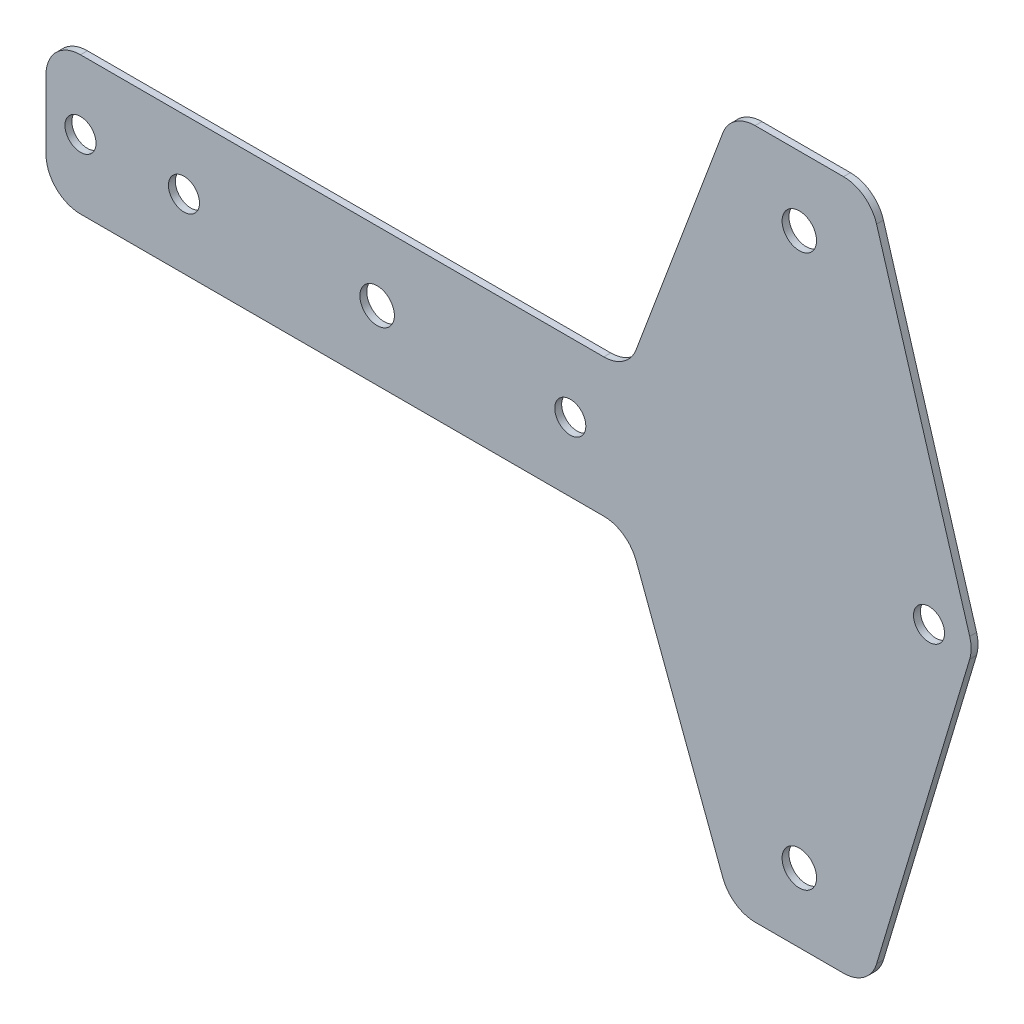
ISO-10303-21;
HEADER;
FILE_DESCRIPTION(('STEP AP214'),'2;1');
FILE_NAME('part.step','',(''),(''),'','','');
FILE_SCHEMA(('AUTOMOTIVE_DESIGN { 1 0 10303 214 1 1 1 1 }'));
ENDSEC;
DATA;
#1=APPLICATION_CONTEXT('core data for automotive mechanical design processes');
#2=APPLICATION_PROTOCOL_DEFINITION('international standard','automotive_design',2000,#1);
#3=PRODUCT_CONTEXT('',#1,'mechanical');
#4=PRODUCT('Part','Part','',(#3));
#5=PRODUCT_RELATED_PRODUCT_CATEGORY('part','',(#4));
#6=PRODUCT_DEFINITION_FORMATION('','',#4);
#7=PRODUCT_DEFINITION_CONTEXT('part definition',#1,'design');
#8=PRODUCT_DEFINITION('design','',#6,#7);
#9=PRODUCT_DEFINITION_SHAPE('','',#8);
#10=(LENGTH_UNIT() NAMED_UNIT(*) SI_UNIT(.MILLI.,.METRE.));
#11=(NAMED_UNIT(*) PLANE_ANGLE_UNIT() SI_UNIT($,.RADIAN.));
#12=(NAMED_UNIT(*) SI_UNIT($,.STERADIAN.) SOLID_ANGLE_UNIT());
#13=UNCERTAINTY_MEASURE_WITH_UNIT(LENGTH_MEASURE(1.E-05),#10,'distance_accuracy_value','');
#14=(GEOMETRIC_REPRESENTATION_CONTEXT(3) GLOBAL_UNCERTAINTY_ASSIGNED_CONTEXT((#13)) GLOBAL_UNIT_ASSIGNED_CONTEXT((#10,
#11,#12)) REPRESENTATION_CONTEXT('',''));
#15=CARTESIAN_POINT('',(0.,0.,0.));
#16=DIRECTION('',(0.,0.,1.));
#17=DIRECTION('',(1.,0.,0.));
#18=AXIS2_PLACEMENT_3D('',#15,#16,#17);
#19=CARTESIAN_POINT('',(13.6987853875845,15.,-1.));
#20=DIRECTION('',(0.,0.,1.));
#21=DIRECTION('',(1.,0.,0.));
#22=AXIS2_PLACEMENT_3D('',#19,#20,#21);
#23=CYLINDRICAL_SURFACE('',#22,5.);
#24=CARTESIAN_POINT('',(13.6987853875845,15.,0.));
#25=DIRECTION('',(0.,0.,-1.));
#26=DIRECTION('',(1.,0.,0.));
#27=AXIS2_PLACEMENT_3D('',#24,#25,#26);
#28=CIRCLE('',#27,5.);
#29=CARTESIAN_POINT('',(18.3804312754297,13.244382792058,0.));
#30=VERTEX_POINT('',#29);
#31=CARTESIAN_POINT('',(13.6987853875845,10.,0.));
#32=VERTEX_POINT('',#31);
#33=EDGE_CURVE('E197',#30,#32,#28,.T.);
#34=ORIENTED_EDGE('',*,*,#33,.F.);
#35=DIRECTION('',(0.,0.,1.));
#36=VECTOR('',#35,1.);
#37=CARTESIAN_POINT('',(18.3804312754297,13.244382792058,-1.));
#38=LINE('',#37,#36);
#39=CARTESIAN_POINT('',(18.3804312754297,13.244382792058,-1.));
#40=VERTEX_POINT('',#39);
#41=EDGE_CURVE('E11',#40,#30,#38,.T.);
#42=ORIENTED_EDGE('',*,*,#41,.F.);
#43=CARTESIAN_POINT('',(13.6987853875845,15.,-1.));
#44=DIRECTION('',(0.,0.,-1.));
#45=DIRECTION('',(1.,0.,0.));
#46=AXIS2_PLACEMENT_3D('',#43,#44,#45);
#47=CIRCLE('',#46,5.);
#48=CARTESIAN_POINT('',(13.6987853875845,10.,-1.));
#49=VERTEX_POINT('',#48);
#50=EDGE_CURVE('E248',#40,#49,#47,.T.);
#51=ORIENTED_EDGE('',*,*,#50,.T.);
#52=DIRECTION('',(0.,0.,1.));
#53=VECTOR('',#52,1.);
#54=CARTESIAN_POINT('',(13.6987853875845,10.,-1.));
#55=LINE('',#54,#53);
#56=EDGE_CURVE('E43',#49,#32,#55,.T.);
#57=ORIENTED_EDGE('',*,*,#56,.T.);
#58=EDGE_LOOP('',(#34,#42,#51,#57));
#59=FACE_BOUND('',#58,.T.);
#60=ADVANCED_FACE('F40',(#59),#23,.F.);
#61=CARTESIAN_POINT('',(18.3804312754297,13.244382792058,-1.));
#62=DIRECTION('',(-0.936329177569045,0.351123441588392,0.));
#63=DIRECTION('',(-0.351123441588392,-0.936329177569045,0.));
#64=AXIS2_PLACEMENT_3D('',#61,#62,#63);
#65=PLANE('',#64);
#66=DIRECTION('',(-0.351123441588392,-0.936329177569044,0.));
#67=VECTOR('',#66,1.);
#68=CARTESIAN_POINT('',(18.3804312754297,13.244382792058,0.));
#69=LINE('',#68,#67);
#70=CARTESIAN_POINT('',(30.9471441813862,46.755617207942,0.));
#71=VERTEX_POINT('',#70);
#72=EDGE_CURVE('E246',#71,#30,#69,.T.);
#73=ORIENTED_EDGE('',*,*,#72,.F.);
#74=DIRECTION('',(0.,0.,1.));
#75=VECTOR('',#74,1.);
#76=CARTESIAN_POINT('',(30.9471441813862,46.755617207942,-1.));
#77=LINE('',#76,#75);
#78=CARTESIAN_POINT('',(30.9471441813862,46.755617207942,-1.));
#79=VERTEX_POINT('',#78);
#80=EDGE_CURVE('E49',#79,#71,#77,.T.);
#81=ORIENTED_EDGE('',*,*,#80,.F.);
#82=DIRECTION('',(-0.351123441588392,-0.936329177569044,0.));
#83=VECTOR('',#82,1.);
#84=CARTESIAN_POINT('',(18.3804312754297,13.244382792058,-1.));
#85=LINE('',#84,#83);
#86=EDGE_CURVE('E187',#79,#40,#85,.T.);
#87=ORIENTED_EDGE('',*,*,#86,.T.);
#88=ORIENTED_EDGE('',*,*,#41,.T.);
#89=EDGE_LOOP('',(#73,#81,#87,#88));
#90=FACE_BOUND('',#89,.T.);
#91=ADVANCED_FACE('F280',(#90),#65,.T.);
#92=CARTESIAN_POINT('',(35.6287900692314,45.,-1.));
#93=DIRECTION('',(0.,0.,1.));
#94=DIRECTION('',(1.,0.,0.));
#95=AXIS2_PLACEMENT_3D('',#92,#93,#94);
#96=CYLINDRICAL_SURFACE('',#95,4.99999999999999);
#97=CARTESIAN_POINT('',(35.6287900692314,45.,0.));
#98=DIRECTION('',(0.,0.,1.));
#99=DIRECTION('',(-1.,0.,0.));
#100=AXIS2_PLACEMENT_3D('',#97,#98,#99);
#101=CIRCLE('',#100,4.99999999999999);
#102=CARTESIAN_POINT('',(35.6287900692314,50.,0.));
#103=VERTEX_POINT('',#102);
#104=EDGE_CURVE('E174',#103,#71,#101,.T.);
#105=ORIENTED_EDGE('',*,*,#104,.F.);
#106=DIRECTION('',(0.,0.,1.));
#107=VECTOR('',#106,1.);
#108=CARTESIAN_POINT('',(35.6287900692314,50.,-1.));
#109=LINE('',#108,#107);
#110=CARTESIAN_POINT('',(35.6287900692314,50.,-1.));
#111=VERTEX_POINT('',#110);
#112=EDGE_CURVE('E169',#111,#103,#109,.T.);
#113=ORIENTED_EDGE('',*,*,#112,.F.);
#114=CARTESIAN_POINT('',(35.6287900692314,45.,-1.));
#115=DIRECTION('',(0.,0.,1.));
#116=DIRECTION('',(-1.,0.,0.));
#117=AXIS2_PLACEMENT_3D('',#114,#115,#116);
#118=CIRCLE('',#117,4.99999999999999);
#119=EDGE_CURVE('E172',#111,#79,#118,.T.);
#120=ORIENTED_EDGE('',*,*,#119,.T.);
#121=ORIENTED_EDGE('',*,*,#80,.T.);
#122=EDGE_LOOP('',(#105,#113,#120,#121));
#123=FACE_BOUND('',#122,.T.);
#124=ADVANCED_FACE('F171',(#123),#96,.T.);
#125=CARTESIAN_POINT('',(35.6287900692314,50.,-1.));
#126=DIRECTION('',(0.,1.,0.));
#127=DIRECTION('',(0.,0.,1.));
#128=AXIS2_PLACEMENT_3D('',#125,#126,#127);
#129=PLANE('',#128);
#130=DIRECTION('',(-1.,0.,0.));
#131=VECTOR('',#130,1.);
#132=CARTESIAN_POINT('',(35.6287900692314,50.,0.));
#133=LINE('',#132,#131);
#134=CARTESIAN_POINT('',(48.4436344739527,50.,0.));
#135=VERTEX_POINT('',#134);
#136=EDGE_CURVE('E243',#135,#103,#133,.T.);
#137=ORIENTED_EDGE('',*,*,#136,.F.);
#138=DIRECTION('',(0.,0.,1.));
#139=VECTOR('',#138,1.);
#140=CARTESIAN_POINT('',(48.4436344739527,50.,-1.));
#141=LINE('',#140,#139);
#142=CARTESIAN_POINT('',(48.4436344739527,50.,-1.));
#143=VERTEX_POINT('',#142);
#144=EDGE_CURVE('E179',#143,#135,#141,.T.);
#145=ORIENTED_EDGE('',*,*,#144,.F.);
#146=DIRECTION('',(-1.,0.,0.));
#147=VECTOR('',#146,1.);
#148=CARTESIAN_POINT('',(35.6287900692314,50.,-1.));
#149=LINE('',#148,#147);
#150=EDGE_CURVE('E185',#143,#111,#149,.T.);
#151=ORIENTED_EDGE('',*,*,#150,.T.);
#152=ORIENTED_EDGE('',*,*,#112,.T.);
#153=EDGE_LOOP('',(#137,#145,#151,#152));
#154=FACE_BOUND('',#153,.T.);
#155=ADVANCED_FACE('F189',(#154),#129,.T.);
#156=CARTESIAN_POINT('',(48.4436344739527,45.,-1.));
#157=DIRECTION('',(0.,0.,1.));
#158=DIRECTION('',(1.,0.,0.));
#159=AXIS2_PLACEMENT_3D('',#156,#157,#158);
#160=CYLINDRICAL_SURFACE('',#159,5.);
#161=CARTESIAN_POINT('',(48.4436344739527,45.,0.));
#162=DIRECTION('',(0.,0.,1.));
#163=DIRECTION('',(-1.,0.,0.));
#164=AXIS2_PLACEMENT_3D('',#161,#162,#163);
#165=CIRCLE('',#164,5.);
#166=CARTESIAN_POINT('',(53.2327659000585,46.4367394278317,0.));
#167=VERTEX_POINT('',#166);
#168=EDGE_CURVE('E240',#167,#135,#165,.T.);
#169=ORIENTED_EDGE('',*,*,#168,.F.);
#170=DIRECTION('',(0.,0.,1.));
#171=VECTOR('',#170,1.);
#172=CARTESIAN_POINT('',(53.2327659000585,46.4367394278317,-1.));
#173=LINE('',#172,#171);
#174=CARTESIAN_POINT('',(53.2327659000585,46.4367394278317,-1.));
#175=VERTEX_POINT('',#174);
#176=EDGE_CURVE('E252',#175,#167,#173,.T.);
#177=ORIENTED_EDGE('',*,*,#176,.F.);
#178=CARTESIAN_POINT('',(48.4436344739527,45.,-1.));
#179=DIRECTION('',(0.,0.,1.));
#180=DIRECTION('',(-1.,0.,0.));
#181=AXIS2_PLACEMENT_3D('',#178,#179,#180);
#182=CIRCLE('',#181,5.);
#183=EDGE_CURVE('E190',#175,#143,#182,.T.);
#184=ORIENTED_EDGE('',*,*,#183,.T.);
#185=ORIENTED_EDGE('',*,*,#144,.T.);
#186=EDGE_LOOP('',(#169,#177,#184,#185));
#187=FACE_BOUND('',#186,.T.);
#188=ADVANCED_FACE('F293',(#187),#160,.T.);
#189=CARTESIAN_POINT('',(53.2327659000585,46.4367394278317,-1.));
#190=DIRECTION('',(0.957826285221152,0.287347885566345,0.));
#191=DIRECTION('',(-0.287347885566345,0.957826285221152,0.));
#192=AXIS2_PLACEMENT_3D('',#189,#190,#191);
#193=PLANE('',#192);
#194=DIRECTION('',(-0.287347885566345,0.957826285221152,0.));
#195=VECTOR('',#194,1.);
#196=CARTESIAN_POINT('',(53.2327659000585,46.4367394278317,0.));
#197=LINE('',#196,#195);
#198=CARTESIAN_POINT('',(66.7327659000584,1.43673942783173,0.));
#199=VERTEX_POINT('',#198);
#200=EDGE_CURVE('E237',#199,#167,#197,.T.);
#201=ORIENTED_EDGE('',*,*,#200,.F.);
#202=DIRECTION('',(0.,0.,1.));
#203=VECTOR('',#202,1.);
#204=CARTESIAN_POINT('',(66.7327659000584,1.43673942783173,-1.));
#205=LINE('',#204,#203);
#206=CARTESIAN_POINT('',(66.7327659000584,1.43673942783173,-1.));
#207=VERTEX_POINT('',#206);
#208=EDGE_CURVE('E254',#207,#199,#205,.T.);
#209=ORIENTED_EDGE('',*,*,#208,.F.);
#210=DIRECTION('',(-0.287347885566345,0.957826285221152,0.));
#211=VECTOR('',#210,1.);
#212=CARTESIAN_POINT('',(53.2327659000585,46.4367394278317,-1.));
#213=LINE('',#212,#211);
#214=EDGE_CURVE('E192',#207,#175,#213,.T.);
#215=ORIENTED_EDGE('',*,*,#214,.T.);
#216=ORIENTED_EDGE('',*,*,#176,.T.);
#217=EDGE_LOOP('',(#201,#209,#215,#216));
#218=FACE_BOUND('',#217,.T.);
#219=ADVANCED_FACE('F296',(#218),#193,.T.);
#220=CARTESIAN_POINT('',(61.9436344739527,0.,-1.));
#221=DIRECTION('',(0.,0.,1.));
#222=DIRECTION('',(1.,0.,0.));
#223=AXIS2_PLACEMENT_3D('',#220,#221,#222);
#224=CYLINDRICAL_SURFACE('',#223,5.00000000000001);
#225=CARTESIAN_POINT('',(61.9436344739527,0.,0.));
#226=DIRECTION('',(0.,0.,1.));
#227=DIRECTION('',(-1.,0.,0.));
#228=AXIS2_PLACEMENT_3D('',#225,#226,#227);
#229=CIRCLE('',#228,5.00000000000001);
#230=CARTESIAN_POINT('',(66.7327659000584,-1.43673942783173,0.));
#231=VERTEX_POINT('',#230);
#232=EDGE_CURVE('E234',#231,#199,#229,.T.);
#233=ORIENTED_EDGE('',*,*,#232,.F.);
#234=DIRECTION('',(0.,0.,1.));
#235=VECTOR('',#234,1.);
#236=CARTESIAN_POINT('',(66.7327659000584,-1.43673942783173,-1.));
#237=LINE('',#236,#235);
#238=CARTESIAN_POINT('',(66.7327659000584,-1.43673942783173,-1.));
#239=VERTEX_POINT('',#238);
#240=EDGE_CURVE('E256',#239,#231,#237,.T.);
#241=ORIENTED_EDGE('',*,*,#240,.F.);
#242=CARTESIAN_POINT('',(61.9436344739527,0.,-1.));
#243=DIRECTION('',(0.,0.,1.));
#244=DIRECTION('',(-1.,0.,0.));
#245=AXIS2_PLACEMENT_3D('',#242,#243,#244);
#246=CIRCLE('',#245,5.00000000000001);
#247=EDGE_CURVE('E462',#239,#207,#246,.T.);
#248=ORIENTED_EDGE('',*,*,#247,.T.);
#249=ORIENTED_EDGE('',*,*,#208,.T.);
#250=EDGE_LOOP('',(#233,#241,#248,#249));
#251=FACE_BOUND('',#250,.T.);
#252=ADVANCED_FACE('F300',(#251),#224,.T.);
#253=CARTESIAN_POINT('',(66.7327659000584,-1.43673942783173,-1.));
#254=DIRECTION('',(0.957826285221152,-0.287347885566345,0.));
#255=DIRECTION('',(0.287347885566345,0.957826285221152,0.));
#256=AXIS2_PLACEMENT_3D('',#253,#254,#255);
#257=PLANE('',#256);
#258=DIRECTION('',(0.287347885566345,0.957826285221152,0.));
#259=VECTOR('',#258,1.);
#260=CARTESIAN_POINT('',(66.7327659000584,-1.43673942783173,0.));
#261=LINE('',#260,#259);
#262=CARTESIAN_POINT('',(53.2327659000585,-46.4367394278317,0.));
#263=VERTEX_POINT('',#262);
#264=EDGE_CURVE('E231',#263,#231,#261,.T.);
#265=ORIENTED_EDGE('',*,*,#264,.F.);
#266=DIRECTION('',(0.,0.,1.));
#267=VECTOR('',#266,1.);
#268=CARTESIAN_POINT('',(53.2327659000585,-46.4367394278317,-1.));
#269=LINE('',#268,#267);
#270=CARTESIAN_POINT('',(53.2327659000585,-46.4367394278317,-1.));
#271=VERTEX_POINT('',#270);
#272=EDGE_CURVE('E258',#271,#263,#269,.T.);
#273=ORIENTED_EDGE('',*,*,#272,.F.);
#274=DIRECTION('',(0.287347885566345,0.957826285221152,0.));
#275=VECTOR('',#274,1.);
#276=CARTESIAN_POINT('',(66.7327659000584,-1.43673942783173,-1.));
#277=LINE('',#276,#275);
#278=EDGE_CURVE('E459',#271,#239,#277,.T.);
#279=ORIENTED_EDGE('',*,*,#278,.T.);
#280=ORIENTED_EDGE('',*,*,#240,.T.);
#281=EDGE_LOOP('',(#265,#273,#279,#280));
#282=FACE_BOUND('',#281,.T.);
#283=ADVANCED_FACE('F304',(#282),#257,.T.);
#284=CARTESIAN_POINT('',(48.4436344739527,-45.,-1.));
#285=DIRECTION('',(0.,0.,1.));
#286=DIRECTION('',(1.,0.,0.));
#287=AXIS2_PLACEMENT_3D('',#284,#285,#286);
#288=CYLINDRICAL_SURFACE('',#287,5.);
#289=CARTESIAN_POINT('',(48.4436344739527,-45.,0.));
#290=DIRECTION('',(0.,0.,1.));
#291=DIRECTION('',(-1.,0.,0.));
#292=AXIS2_PLACEMENT_3D('',#289,#290,#291);
#293=CIRCLE('',#292,5.);
#294=CARTESIAN_POINT('',(48.4436344739527,-50.,0.));
#295=VERTEX_POINT('',#294);
#296=EDGE_CURVE('E228',#295,#263,#293,.T.);
#297=ORIENTED_EDGE('',*,*,#296,.F.);
#298=DIRECTION('',(0.,0.,1.));
#299=VECTOR('',#298,1.);
#300=CARTESIAN_POINT('',(48.4436344739527,-50.,-1.));
#301=LINE('',#300,#299);
#302=CARTESIAN_POINT('',(48.4436344739527,-50.,-1.));
#303=VERTEX_POINT('',#302);
#304=EDGE_CURVE('E260',#303,#295,#301,.T.);
#305=ORIENTED_EDGE('',*,*,#304,.F.);
#306=CARTESIAN_POINT('',(48.4436344739527,-45.,-1.));
#307=DIRECTION('',(0.,0.,1.));
#308=DIRECTION('',(-1.,0.,0.));
#309=AXIS2_PLACEMENT_3D('',#306,#307,#308);
#310=CIRCLE('',#309,5.);
#311=EDGE_CURVE('E456',#303,#271,#310,.T.);
#312=ORIENTED_EDGE('',*,*,#311,.T.);
#313=ORIENTED_EDGE('',*,*,#272,.T.);
#314=EDGE_LOOP('',(#297,#305,#312,#313));
#315=FACE_BOUND('',#314,.T.);
#316=ADVANCED_FACE('F308',(#315),#288,.T.);
#317=CARTESIAN_POINT('',(48.4436344739527,-50.,-1.));
#318=DIRECTION('',(0.,-1.,0.));
#319=DIRECTION('',(0.,0.,-1.));
#320=AXIS2_PLACEMENT_3D('',#317,#318,#319);
#321=PLANE('',#320);
#322=DIRECTION('',(1.,0.,0.));
#323=VECTOR('',#322,1.);
#324=CARTESIAN_POINT('',(48.4436344739527,-50.,0.));
#325=LINE('',#324,#323);
#326=CARTESIAN_POINT('',(35.6287900692314,-50.,0.));
#327=VERTEX_POINT('',#326);
#328=EDGE_CURVE('E225',#327,#295,#325,.T.);
#329=ORIENTED_EDGE('',*,*,#328,.F.);
#330=DIRECTION('',(0.,0.,1.));
#331=VECTOR('',#330,1.);
#332=CARTESIAN_POINT('',(35.6287900692314,-50.,-1.));
#333=LINE('',#332,#331);
#334=CARTESIAN_POINT('',(35.6287900692314,-50.,-1.));
#335=VERTEX_POINT('',#334);
#336=EDGE_CURVE('E262',#335,#327,#333,.T.);
#337=ORIENTED_EDGE('',*,*,#336,.F.);
#338=DIRECTION('',(1.,0.,0.));
#339=VECTOR('',#338,1.);
#340=CARTESIAN_POINT('',(48.4436344739527,-50.,-1.));
#341=LINE('',#340,#339);
#342=EDGE_CURVE('E453',#335,#303,#341,.T.);
#343=ORIENTED_EDGE('',*,*,#342,.T.);
#344=ORIENTED_EDGE('',*,*,#304,.T.);
#345=EDGE_LOOP('',(#329,#337,#343,#344));
#346=FACE_BOUND('',#345,.T.);
#347=ADVANCED_FACE('F312',(#346),#321,.T.);
#348=CARTESIAN_POINT('',(35.6287900692314,-45.,-1.));
#349=DIRECTION('',(0.,0.,1.));
#350=DIRECTION('',(1.,0.,0.));
#351=AXIS2_PLACEMENT_3D('',#348,#349,#350);
#352=CYLINDRICAL_SURFACE('',#351,4.99999999999999);
#353=CARTESIAN_POINT('',(35.6287900692314,-45.,0.));
#354=DIRECTION('',(0.,0.,1.));
#355=DIRECTION('',(-1.,0.,0.));
#356=AXIS2_PLACEMENT_3D('',#353,#354,#355);
#357=CIRCLE('',#356,4.99999999999999);
#358=CARTESIAN_POINT('',(30.9471441813862,-46.755617207942,0.));
#359=VERTEX_POINT('',#358);
#360=EDGE_CURVE('E222',#359,#327,#357,.T.);
#361=ORIENTED_EDGE('',*,*,#360,.F.);
#362=DIRECTION('',(0.,0.,1.));
#363=VECTOR('',#362,1.);
#364=CARTESIAN_POINT('',(30.9471441813862,-46.755617207942,-1.));
#365=LINE('',#364,#363);
#366=CARTESIAN_POINT('',(30.9471441813862,-46.755617207942,-1.));
#367=VERTEX_POINT('',#366);
#368=EDGE_CURVE('E264',#367,#359,#365,.T.);
#369=ORIENTED_EDGE('',*,*,#368,.F.);
#370=CARTESIAN_POINT('',(35.6287900692314,-45.,-1.));
#371=DIRECTION('',(0.,0.,1.));
#372=DIRECTION('',(-1.,0.,0.));
#373=AXIS2_PLACEMENT_3D('',#370,#371,#372);
#374=CIRCLE('',#373,4.99999999999999);
#375=EDGE_CURVE('E450',#367,#335,#374,.T.);
#376=ORIENTED_EDGE('',*,*,#375,.T.);
#377=ORIENTED_EDGE('',*,*,#336,.T.);
#378=EDGE_LOOP('',(#361,#369,#376,#377));
#379=FACE_BOUND('',#378,.T.);
#380=ADVANCED_FACE('F316',(#379),#352,.T.);
#381=CARTESIAN_POINT('',(30.9471441813862,-46.755617207942,-1.));
#382=DIRECTION('',(-0.936329177569045,-0.351123441588392,0.));
#383=DIRECTION('',(0.351123441588392,-0.936329177569045,0.));
#384=AXIS2_PLACEMENT_3D('',#381,#382,#383);
#385=PLANE('',#384);
#386=DIRECTION('',(0.351123441588392,-0.936329177569044,0.));
#387=VECTOR('',#386,1.);
#388=CARTESIAN_POINT('',(30.9471441813862,-46.755617207942,0.));
#389=LINE('',#388,#387);
#390=CARTESIAN_POINT('',(18.3804312754297,-13.244382792058,0.));
#391=VERTEX_POINT('',#390);
#392=EDGE_CURVE('E219',#391,#359,#389,.T.);
#393=ORIENTED_EDGE('',*,*,#392,.F.);
#394=DIRECTION('',(0.,0.,1.));
#395=VECTOR('',#394,1.);
#396=CARTESIAN_POINT('',(18.3804312754297,-13.244382792058,-1.));
#397=LINE('',#396,#395);
#398=CARTESIAN_POINT('',(18.3804312754297,-13.244382792058,-1.));
#399=VERTEX_POINT('',#398);
#400=EDGE_CURVE('E266',#399,#391,#397,.T.);
#401=ORIENTED_EDGE('',*,*,#400,.F.);
#402=DIRECTION('',(0.351123441588392,-0.936329177569044,0.));
#403=VECTOR('',#402,1.);
#404=CARTESIAN_POINT('',(30.9471441813862,-46.755617207942,-1.));
#405=LINE('',#404,#403);
#406=EDGE_CURVE('E447',#399,#367,#405,.T.);
#407=ORIENTED_EDGE('',*,*,#406,.T.);
#408=ORIENTED_EDGE('',*,*,#368,.T.);
#409=EDGE_LOOP('',(#393,#401,#407,#408));
#410=FACE_BOUND('',#409,.T.);
#411=ADVANCED_FACE('F320',(#410),#385,.T.);
#412=CARTESIAN_POINT('',(13.6987853875845,-15.,-1.));
#413=DIRECTION('',(0.,0.,1.));
#414=DIRECTION('',(1.,0.,0.));
#415=AXIS2_PLACEMENT_3D('',#412,#413,#414);
#416=CYLINDRICAL_SURFACE('',#415,5.);
#417=CARTESIAN_POINT('',(13.6987853875845,-15.,0.));
#418=DIRECTION('',(0.,0.,-1.));
#419=DIRECTION('',(1.,0.,0.));
#420=AXIS2_PLACEMENT_3D('',#417,#418,#419);
#421=CIRCLE('',#420,5.);
#422=CARTESIAN_POINT('',(13.6987853875845,-10.,0.));
#423=VERTEX_POINT('',#422);
#424=EDGE_CURVE('E216',#423,#391,#421,.T.);
#425=ORIENTED_EDGE('',*,*,#424,.F.);
#426=DIRECTION('',(0.,0.,1.));
#427=VECTOR('',#426,1.);
#428=CARTESIAN_POINT('',(13.6987853875845,-10.,-1.));
#429=LINE('',#428,#427);
#430=CARTESIAN_POINT('',(13.6987853875845,-10.,-1.));
#431=VERTEX_POINT('',#430);
#432=EDGE_CURVE('E268',#431,#423,#429,.T.);
#433=ORIENTED_EDGE('',*,*,#432,.F.);
#434=CARTESIAN_POINT('',(13.6987853875845,-15.,-1.));
#435=DIRECTION('',(0.,0.,-1.));
#436=DIRECTION('',(1.,0.,0.));
#437=AXIS2_PLACEMENT_3D('',#434,#435,#436);
#438=CIRCLE('',#437,5.);
#439=EDGE_CURVE('E444',#431,#399,#438,.T.);
#440=ORIENTED_EDGE('',*,*,#439,.T.);
#441=ORIENTED_EDGE('',*,*,#400,.T.);
#442=EDGE_LOOP('',(#425,#433,#440,#441));
#443=FACE_BOUND('',#442,.T.);
#444=ADVANCED_FACE('F324',(#443),#416,.F.);
#445=CARTESIAN_POINT('',(13.6987853875845,-10.,-1.));
#446=DIRECTION('',(0.,-1.,0.));
#447=DIRECTION('',(1.,0.,0.));
#448=AXIS2_PLACEMENT_3D('',#445,#446,#447);
#449=PLANE('',#448);
#450=DIRECTION('',(1.,0.,0.));
#451=VECTOR('',#450,1.);
#452=CARTESIAN_POINT('',(13.6987853875845,-10.,0.));
#453=LINE('',#452,#451);
#454=CARTESIAN_POINT('',(-62.163787728408,-10.,0.));
#455=VERTEX_POINT('',#454);
#456=EDGE_CURVE('E213',#455,#423,#453,.T.);
#457=ORIENTED_EDGE('',*,*,#456,.F.);
#458=DIRECTION('',(0.,0.,1.));
#459=VECTOR('',#458,1.);
#460=CARTESIAN_POINT('',(-62.163787728408,-10.,-1.));
#461=LINE('',#460,#459);
#462=CARTESIAN_POINT('',(-62.163787728408,-10.,-1.));
#463=VERTEX_POINT('',#462);
#464=EDGE_CURVE('E270',#463,#455,#461,.T.);
#465=ORIENTED_EDGE('',*,*,#464,.F.);
#466=DIRECTION('',(1.,0.,0.));
#467=VECTOR('',#466,1.);
#468=CARTESIAN_POINT('',(13.6987853875845,-10.,-1.));
#469=LINE('',#468,#467);
#470=EDGE_CURVE('E441',#463,#431,#469,.T.);
#471=ORIENTED_EDGE('',*,*,#470,.T.);
#472=ORIENTED_EDGE('',*,*,#432,.T.);
#473=EDGE_LOOP('',(#457,#465,#471,#472));
#474=FACE_BOUND('',#473,.T.);
#475=ADVANCED_FACE('F328',(#474),#449,.T.);
#476=CARTESIAN_POINT('',(-62.163787728408,-5.,-1.));
#477=DIRECTION('',(0.,0.,1.));
#478=DIRECTION('',(1.,0.,0.));
#479=AXIS2_PLACEMENT_3D('',#476,#477,#478);
#480=CYLINDRICAL_SURFACE('',#479,5.);
#481=CARTESIAN_POINT('',(-62.163787728408,-5.,0.));
#482=DIRECTION('',(0.,0.,1.));
#483=DIRECTION('',(-1.,0.,0.));
#484=AXIS2_PLACEMENT_3D('',#481,#482,#483);
#485=CIRCLE('',#484,5.);
#486=CARTESIAN_POINT('',(-67.163787728408,-5.,0.));
#487=VERTEX_POINT('',#486);
#488=EDGE_CURVE('E210',#487,#455,#485,.T.);
#489=ORIENTED_EDGE('',*,*,#488,.F.);
#490=DIRECTION('',(0.,0.,1.));
#491=VECTOR('',#490,1.);
#492=CARTESIAN_POINT('',(-67.163787728408,-5.,-1.));
#493=LINE('',#492,#491);
#494=CARTESIAN_POINT('',(-67.163787728408,-5.,-1.));
#495=VERTEX_POINT('',#494);
#496=EDGE_CURVE('E272',#495,#487,#493,.T.);
#497=ORIENTED_EDGE('',*,*,#496,.F.);
#498=CARTESIAN_POINT('',(-62.163787728408,-5.,-1.));
#499=DIRECTION('',(0.,0.,1.));
#500=DIRECTION('',(-1.,0.,0.));
#501=AXIS2_PLACEMENT_3D('',#498,#499,#500);
#502=CIRCLE('',#501,5.);
#503=EDGE_CURVE('E438',#495,#463,#502,.T.);
#504=ORIENTED_EDGE('',*,*,#503,.T.);
#505=ORIENTED_EDGE('',*,*,#464,.T.);
#506=EDGE_LOOP('',(#489,#497,#504,#505));
#507=FACE_BOUND('',#506,.T.);
#508=ADVANCED_FACE('F332',(#507),#480,.T.);
#509=CARTESIAN_POINT('',(-67.163787728408,-5.,-1.));
#510=DIRECTION('',(-1.,0.,0.));
#511=DIRECTION('',(0.,0.,1.));
#512=AXIS2_PLACEMENT_3D('',#509,#510,#511);
#513=PLANE('',#512);
#514=DIRECTION('',(0.,-1.,0.));
#515=VECTOR('',#514,1.);
#516=CARTESIAN_POINT('',(-67.163787728408,-5.,0.));
#517=LINE('',#516,#515);
#518=CARTESIAN_POINT('',(-67.163787728408,5.,0.));
#519=VERTEX_POINT('',#518);
#520=EDGE_CURVE('E207',#519,#487,#517,.T.);
#521=ORIENTED_EDGE('',*,*,#520,.F.);
#522=DIRECTION('',(0.,0.,1.));
#523=VECTOR('',#522,1.);
#524=CARTESIAN_POINT('',(-67.163787728408,5.,-1.));
#525=LINE('',#524,#523);
#526=CARTESIAN_POINT('',(-67.163787728408,5.,-1.));
#527=VERTEX_POINT('',#526);
#528=EDGE_CURVE('E274',#527,#519,#525,.T.);
#529=ORIENTED_EDGE('',*,*,#528,.F.);
#530=DIRECTION('',(0.,-1.,0.));
#531=VECTOR('',#530,1.);
#532=CARTESIAN_POINT('',(-67.163787728408,-5.,-1.));
#533=LINE('',#532,#531);
#534=EDGE_CURVE('E435',#527,#495,#533,.T.);
#535=ORIENTED_EDGE('',*,*,#534,.T.);
#536=ORIENTED_EDGE('',*,*,#496,.T.);
#537=EDGE_LOOP('',(#521,#529,#535,#536));
#538=FACE_BOUND('',#537,.T.);
#539=ADVANCED_FACE('F336',(#538),#513,.T.);
#540=CARTESIAN_POINT('',(-62.163787728408,5.,-1.));
#541=DIRECTION('',(0.,0.,1.));
#542=DIRECTION('',(1.,0.,0.));
#543=AXIS2_PLACEMENT_3D('',#540,#541,#542);
#544=CYLINDRICAL_SURFACE('',#543,5.);
#545=CARTESIAN_POINT('',(-62.163787728408,5.,0.));
#546=DIRECTION('',(0.,0.,1.));
#547=DIRECTION('',(1.,0.,0.));
#548=AXIS2_PLACEMENT_3D('',#545,#546,#547);
#549=CIRCLE('',#548,5.);
#550=CARTESIAN_POINT('',(-62.163787728408,10.,0.));
#551=VERTEX_POINT('',#550);
#552=EDGE_CURVE('E204',#551,#519,#549,.T.);
#553=ORIENTED_EDGE('',*,*,#552,.F.);
#554=DIRECTION('',(0.,0.,1.));
#555=VECTOR('',#554,1.);
#556=CARTESIAN_POINT('',(-62.163787728408,10.,-1.));
#557=LINE('',#556,#555);
#558=CARTESIAN_POINT('',(-62.163787728408,10.,-1.));
#559=VERTEX_POINT('',#558);
#560=EDGE_CURVE('E275',#559,#551,#557,.T.);
#561=ORIENTED_EDGE('',*,*,#560,.F.);
#562=CARTESIAN_POINT('',(-62.163787728408,5.,-1.));
#563=DIRECTION('',(0.,0.,1.));
#564=DIRECTION('',(1.,0.,0.));
#565=AXIS2_PLACEMENT_3D('',#562,#563,#564);
#566=CIRCLE('',#565,5.);
#567=EDGE_CURVE('E432',#559,#527,#566,.T.);
#568=ORIENTED_EDGE('',*,*,#567,.T.);
#569=ORIENTED_EDGE('',*,*,#528,.T.);
#570=EDGE_LOOP('',(#553,#561,#568,#569));
#571=FACE_BOUND('',#570,.T.);
#572=ADVANCED_FACE('F340',(#571),#544,.T.);
#573=CARTESIAN_POINT('',(-62.163787728408,10.,-1.));
#574=DIRECTION('',(0.,1.,0.));
#575=DIRECTION('',(-1.,0.,0.));
#576=AXIS2_PLACEMENT_3D('',#573,#574,#575);
#577=PLANE('',#576);
#578=DIRECTION('',(-1.,0.,0.));
#579=VECTOR('',#578,1.);
#580=CARTESIAN_POINT('',(-62.163787728408,10.,0.));
#581=LINE('',#580,#579);
#582=EDGE_CURVE('E200',#32,#551,#581,.T.);
#583=ORIENTED_EDGE('',*,*,#582,.F.);
#584=ORIENTED_EDGE('',*,*,#56,.F.);
#585=DIRECTION('',(-1.,0.,0.));
#586=VECTOR('',#585,1.);
#587=CARTESIAN_POINT('',(-62.163787728408,10.,-1.));
#588=LINE('',#587,#586);
#589=EDGE_CURVE('E430',#49,#559,#588,.T.);
#590=ORIENTED_EDGE('',*,*,#589,.T.);
#591=ORIENTED_EDGE('',*,*,#560,.T.);
#592=EDGE_LOOP('',(#583,#584,#590,#591));
#593=FACE_BOUND('',#592,.T.);
#594=ADVANCED_FACE('F277',(#593),#577,.T.);
#595=CARTESIAN_POINT('',(13.6987853875845,15.,-1.));
#596=DIRECTION('',(0.,0.,1.));
#597=DIRECTION('',(1.,0.,0.));
#598=AXIS2_PLACEMENT_3D('',#595,#596,#597);
#599=PLANE('',#598);
#600=CARTESIAN_POINT('',(60.836212271592,0.,-1.));
#601=DIRECTION('',(0.,0.,1.));
#602=DIRECTION('',(1.,0.,0.));
#603=AXIS2_PLACEMENT_3D('',#600,#601,#602);
#604=CIRCLE('',#603,2.25);
#605=CARTESIAN_POINT('',(63.086212271592,0.,-1.));
#606=VERTEX_POINT('',#605);
#607=EDGE_CURVE('E387',#606,#606,#604,.T.);
#608=ORIENTED_EDGE('',*,*,#607,.T.);
#609=EDGE_LOOP('',(#608));
#610=FACE_BOUND('',#609,.T.);
#611=CARTESIAN_POINT('',(8.83621227159204,0.,-1.));
#612=DIRECTION('',(0.,0.,1.));
#613=DIRECTION('',(1.,0.,0.));
#614=AXIS2_PLACEMENT_3D('',#611,#612,#613);
#615=CIRCLE('',#614,2.25);
#616=CARTESIAN_POINT('',(11.086212271592,0.,-1.));
#617=VERTEX_POINT('',#616);
#618=EDGE_CURVE('E395',#617,#617,#615,.T.);
#619=ORIENTED_EDGE('',*,*,#618,.T.);
#620=EDGE_LOOP('',(#619));
#621=FACE_BOUND('',#620,.T.);
#622=CARTESIAN_POINT('',(-62.163787728408,0.,-1.));
#623=DIRECTION('',(0.,0.,1.));
#624=DIRECTION('',(1.,0.,0.));
#625=AXIS2_PLACEMENT_3D('',#622,#623,#624);
#626=CIRCLE('',#625,2.25);
#627=CARTESIAN_POINT('',(-59.913787728408,0.,-1.));
#628=VERTEX_POINT('',#627);
#629=EDGE_CURVE('E401',#628,#628,#626,.T.);
#630=ORIENTED_EDGE('',*,*,#629,.T.);
#631=EDGE_LOOP('',(#630));
#632=FACE_BOUND('',#631,.T.);
#633=CARTESIAN_POINT('',(-47.163787728408,0.,-1.));
#634=DIRECTION('',(0.,0.,1.));
#635=DIRECTION('',(1.,0.,0.));
#636=AXIS2_PLACEMENT_3D('',#633,#634,#635);
#637=CIRCLE('',#636,2.25);
#638=CARTESIAN_POINT('',(-44.913787728408,0.,-1.));
#639=VERTEX_POINT('',#638);
#640=EDGE_CURVE('E407',#639,#639,#637,.T.);
#641=ORIENTED_EDGE('',*,*,#640,.T.);
#642=EDGE_LOOP('',(#641));
#643=FACE_BOUND('',#642,.T.);
#644=CARTESIAN_POINT('',(42.036212271592,-40.,-1.));
#645=DIRECTION('',(0.,0.,1.));
#646=DIRECTION('',(1.,0.,0.));
#647=AXIS2_PLACEMENT_3D('',#644,#645,#646);
#648=CIRCLE('',#647,2.5);
#649=CARTESIAN_POINT('',(44.5362122715921,-40.,-1.));
#650=VERTEX_POINT('',#649);
#651=EDGE_CURVE('E413',#650,#650,#648,.T.);
#652=ORIENTED_EDGE('',*,*,#651,.T.);
#653=EDGE_LOOP('',(#652));
#654=FACE_BOUND('',#653,.T.);
#655=CARTESIAN_POINT('',(42.036212271592,40.,-1.));
#656=DIRECTION('',(0.,0.,1.));
#657=DIRECTION('',(1.,0.,0.));
#658=AXIS2_PLACEMENT_3D('',#655,#656,#657);
#659=CIRCLE('',#658,2.5);
#660=CARTESIAN_POINT('',(44.5362122715921,40.,-1.));
#661=VERTEX_POINT('',#660);
#662=EDGE_CURVE('E419',#661,#661,#659,.T.);
#663=ORIENTED_EDGE('',*,*,#662,.T.);
#664=EDGE_LOOP('',(#663));
#665=FACE_BOUND('',#664,.T.);
#666=CARTESIAN_POINT('',(-19.163787728408,0.,-1.));
#667=DIRECTION('',(0.,0.,1.));
#668=DIRECTION('',(1.,0.,0.));
#669=AXIS2_PLACEMENT_3D('',#666,#667,#668);
#670=CIRCLE('',#669,2.5);
#671=CARTESIAN_POINT('',(-16.663787728408,0.,-1.));
#672=VERTEX_POINT('',#671);
#673=EDGE_CURVE('E201',#672,#672,#670,.T.);
#674=ORIENTED_EDGE('',*,*,#673,.T.);
#675=EDGE_LOOP('',(#674));
#676=FACE_BOUND('',#675,.T.);
#677=ORIENTED_EDGE('',*,*,#50,.F.);
#678=ORIENTED_EDGE('',*,*,#86,.F.);
#679=ORIENTED_EDGE('',*,*,#119,.F.);
#680=ORIENTED_EDGE('',*,*,#150,.F.);
#681=ORIENTED_EDGE('',*,*,#183,.F.);
#682=ORIENTED_EDGE('',*,*,#214,.F.);
#683=ORIENTED_EDGE('',*,*,#247,.F.);
#684=ORIENTED_EDGE('',*,*,#278,.F.);
#685=ORIENTED_EDGE('',*,*,#311,.F.);
#686=ORIENTED_EDGE('',*,*,#342,.F.);
#687=ORIENTED_EDGE('',*,*,#375,.F.);
#688=ORIENTED_EDGE('',*,*,#406,.F.);
#689=ORIENTED_EDGE('',*,*,#439,.F.);
#690=ORIENTED_EDGE('',*,*,#470,.F.);
#691=ORIENTED_EDGE('',*,*,#503,.F.);
#692=ORIENTED_EDGE('',*,*,#534,.F.);
#693=ORIENTED_EDGE('',*,*,#567,.F.);
#694=ORIENTED_EDGE('',*,*,#589,.F.);
#695=EDGE_LOOP('',(#677,#678,#679,#680,#681,#682,#683,#684,#685,#686,#687,#688,#689,#690,#691,
#692,#693,#694));
#696=FACE_BOUND('',#695,.T.);
#697=ADVANCED_FACE('F183',(#610,#621,#632,#643,#654,#665,#676,#696),#599,.F.);
#698=CARTESIAN_POINT('',(13.6987853875845,15.,0.));
#699=DIRECTION('',(0.,0.,1.));
#700=DIRECTION('',(1.,0.,0.));
#701=AXIS2_PLACEMENT_3D('',#698,#699,#700);
#702=PLANE('',#701);
#703=CARTESIAN_POINT('',(60.836212271592,0.,0.));
#704=DIRECTION('',(0.,0.,1.));
#705=DIRECTION('',(1.,0.,0.));
#706=AXIS2_PLACEMENT_3D('',#703,#704,#705);
#707=CIRCLE('',#706,2.25);
#708=CARTESIAN_POINT('',(63.086212271592,0.,0.));
#709=VERTEX_POINT('',#708);
#710=EDGE_CURVE('E390',#709,#709,#707,.T.);
#711=ORIENTED_EDGE('',*,*,#710,.F.);
#712=EDGE_LOOP('',(#711));
#713=FACE_BOUND('',#712,.T.);
#714=CARTESIAN_POINT('',(8.83621227159204,0.,0.));
#715=DIRECTION('',(0.,0.,1.));
#716=DIRECTION('',(1.,0.,0.));
#717=AXIS2_PLACEMENT_3D('',#714,#715,#716);
#718=CIRCLE('',#717,2.25);
#719=CARTESIAN_POINT('',(11.086212271592,0.,0.));
#720=VERTEX_POINT('',#719);
#721=EDGE_CURVE('E392',#720,#720,#718,.T.);
#722=ORIENTED_EDGE('',*,*,#721,.F.);
#723=EDGE_LOOP('',(#722));
#724=FACE_BOUND('',#723,.T.);
#725=CARTESIAN_POINT('',(-62.163787728408,0.,0.));
#726=DIRECTION('',(0.,0.,1.));
#727=DIRECTION('',(1.,0.,0.));
#728=AXIS2_PLACEMENT_3D('',#725,#726,#727);
#729=CIRCLE('',#728,2.25);
#730=CARTESIAN_POINT('',(-59.913787728408,0.,0.));
#731=VERTEX_POINT('',#730);
#732=EDGE_CURVE('E398',#731,#731,#729,.T.);
#733=ORIENTED_EDGE('',*,*,#732,.F.);
#734=EDGE_LOOP('',(#733));
#735=FACE_BOUND('',#734,.T.);
#736=CARTESIAN_POINT('',(-47.163787728408,0.,0.));
#737=DIRECTION('',(0.,0.,1.));
#738=DIRECTION('',(1.,0.,0.));
#739=AXIS2_PLACEMENT_3D('',#736,#737,#738);
#740=CIRCLE('',#739,2.25);
#741=CARTESIAN_POINT('',(-44.913787728408,0.,0.));
#742=VERTEX_POINT('',#741);
#743=EDGE_CURVE('E404',#742,#742,#740,.T.);
#744=ORIENTED_EDGE('',*,*,#743,.F.);
#745=EDGE_LOOP('',(#744));
#746=FACE_BOUND('',#745,.T.);
#747=CARTESIAN_POINT('',(42.036212271592,-40.,0.));
#748=DIRECTION('',(0.,0.,1.));
#749=DIRECTION('',(1.,0.,0.));
#750=AXIS2_PLACEMENT_3D('',#747,#748,#749);
#751=CIRCLE('',#750,2.5);
#752=CARTESIAN_POINT('',(44.5362122715921,-40.,0.));
#753=VERTEX_POINT('',#752);
#754=EDGE_CURVE('E410',#753,#753,#751,.T.);
#755=ORIENTED_EDGE('',*,*,#754,.F.);
#756=EDGE_LOOP('',(#755));
#757=FACE_BOUND('',#756,.T.);
#758=CARTESIAN_POINT('',(42.036212271592,40.,0.));
#759=DIRECTION('',(0.,0.,1.));
#760=DIRECTION('',(1.,0.,0.));
#761=AXIS2_PLACEMENT_3D('',#758,#759,#760);
#762=CIRCLE('',#761,2.5);
#763=CARTESIAN_POINT('',(44.5362122715921,40.,0.));
#764=VERTEX_POINT('',#763);
#765=EDGE_CURVE('E416',#764,#764,#762,.T.);
#766=ORIENTED_EDGE('',*,*,#765,.F.);
#767=EDGE_LOOP('',(#766));
#768=FACE_BOUND('',#767,.T.);
#769=CARTESIAN_POINT('',(-19.163787728408,0.,0.));
#770=DIRECTION('',(0.,0.,1.));
#771=DIRECTION('',(1.,0.,0.));
#772=AXIS2_PLACEMENT_3D('',#769,#770,#771);
#773=CIRCLE('',#772,2.5);
#774=CARTESIAN_POINT('',(-16.663787728408,0.,0.));
#775=VERTEX_POINT('',#774);
#776=EDGE_CURVE('E422',#775,#775,#773,.T.);
#777=ORIENTED_EDGE('',*,*,#776,.F.);
#778=EDGE_LOOP('',(#777));
#779=FACE_BOUND('',#778,.T.);
#780=ORIENTED_EDGE('',*,*,#33,.T.);
#781=ORIENTED_EDGE('',*,*,#582,.T.);
#782=ORIENTED_EDGE('',*,*,#552,.T.);
#783=ORIENTED_EDGE('',*,*,#520,.T.);
#784=ORIENTED_EDGE('',*,*,#488,.T.);
#785=ORIENTED_EDGE('',*,*,#456,.T.);
#786=ORIENTED_EDGE('',*,*,#424,.T.);
#787=ORIENTED_EDGE('',*,*,#392,.T.);
#788=ORIENTED_EDGE('',*,*,#360,.T.);
#789=ORIENTED_EDGE('',*,*,#328,.T.);
#790=ORIENTED_EDGE('',*,*,#296,.T.);
#791=ORIENTED_EDGE('',*,*,#264,.T.);
#792=ORIENTED_EDGE('',*,*,#232,.T.);
#793=ORIENTED_EDGE('',*,*,#200,.T.);
#794=ORIENTED_EDGE('',*,*,#168,.T.);
#795=ORIENTED_EDGE('',*,*,#136,.T.);
#796=ORIENTED_EDGE('',*,*,#104,.T.);
#797=ORIENTED_EDGE('',*,*,#72,.T.);
#798=EDGE_LOOP('',(#780,#781,#782,#783,#784,#785,#786,#787,#788,#789,#790,#791,#792,#793,#794,
#795,#796,#797));
#799=FACE_BOUND('',#798,.T.);
#800=ADVANCED_FACE('F279',(#713,#724,#735,#746,#757,#768,#779,#799),#702,.T.);
#801=CARTESIAN_POINT('',(-19.163787728408,0.,-1.));
#802=DIRECTION('',(0.,0.,1.));
#803=DIRECTION('',(1.,0.,0.));
#804=AXIS2_PLACEMENT_3D('',#801,#802,#803);
#805=CYLINDRICAL_SURFACE('',#804,2.5);
#806=ORIENTED_EDGE('',*,*,#673,.F.);
#807=EDGE_LOOP('',(#806));
#808=FACE_BOUND('',#807,.T.);
#809=ORIENTED_EDGE('',*,*,#776,.T.);
#810=EDGE_LOOP('',(#809));
#811=FACE_BOUND('',#810,.T.);
#812=ADVANCED_FACE('F352',(#808,#811),#805,.F.);
#813=CARTESIAN_POINT('',(42.036212271592,40.,-1.));
#814=DIRECTION('',(0.,0.,1.));
#815=DIRECTION('',(1.,0.,0.));
#816=AXIS2_PLACEMENT_3D('',#813,#814,#815);
#817=CYLINDRICAL_SURFACE('',#816,2.5);
#818=ORIENTED_EDGE('',*,*,#662,.F.);
#819=EDGE_LOOP('',(#818));
#820=FACE_BOUND('',#819,.T.);
#821=ORIENTED_EDGE('',*,*,#765,.T.);
#822=EDGE_LOOP('',(#821));
#823=FACE_BOUND('',#822,.T.);
#824=ADVANCED_FACE('F359',(#820,#823),#817,.F.);
#825=CARTESIAN_POINT('',(42.036212271592,-40.,-1.));
#826=DIRECTION('',(0.,0.,1.));
#827=DIRECTION('',(1.,0.,0.));
#828=AXIS2_PLACEMENT_3D('',#825,#826,#827);
#829=CYLINDRICAL_SURFACE('',#828,2.5);
#830=ORIENTED_EDGE('',*,*,#651,.F.);
#831=EDGE_LOOP('',(#830));
#832=FACE_BOUND('',#831,.T.);
#833=ORIENTED_EDGE('',*,*,#754,.T.);
#834=EDGE_LOOP('',(#833));
#835=FACE_BOUND('',#834,.T.);
#836=ADVANCED_FACE('F363',(#832,#835),#829,.F.);
#837=CARTESIAN_POINT('',(-47.163787728408,0.,-1.));
#838=DIRECTION('',(0.,0.,1.));
#839=DIRECTION('',(1.,0.,0.));
#840=AXIS2_PLACEMENT_3D('',#837,#838,#839);
#841=CYLINDRICAL_SURFACE('',#840,2.25);
#842=ORIENTED_EDGE('',*,*,#640,.F.);
#843=EDGE_LOOP('',(#842));
#844=FACE_BOUND('',#843,.T.);
#845=ORIENTED_EDGE('',*,*,#743,.T.);
#846=EDGE_LOOP('',(#845));
#847=FACE_BOUND('',#846,.T.);
#848=ADVANCED_FACE('F367',(#844,#847),#841,.F.);
#849=CARTESIAN_POINT('',(-62.163787728408,0.,-1.));
#850=DIRECTION('',(0.,0.,1.));
#851=DIRECTION('',(1.,0.,0.));
#852=AXIS2_PLACEMENT_3D('',#849,#850,#851);
#853=CYLINDRICAL_SURFACE('',#852,2.25);
#854=ORIENTED_EDGE('',*,*,#629,.F.);
#855=EDGE_LOOP('',(#854));
#856=FACE_BOUND('',#855,.T.);
#857=ORIENTED_EDGE('',*,*,#732,.T.);
#858=EDGE_LOOP('',(#857));
#859=FACE_BOUND('',#858,.T.);
#860=ADVANCED_FACE('F371',(#856,#859),#853,.F.);
#861=CARTESIAN_POINT('',(8.83621227159204,0.,-1.));
#862=DIRECTION('',(0.,0.,1.));
#863=DIRECTION('',(1.,0.,0.));
#864=AXIS2_PLACEMENT_3D('',#861,#862,#863);
#865=CYLINDRICAL_SURFACE('',#864,2.25);
#866=ORIENTED_EDGE('',*,*,#618,.F.);
#867=EDGE_LOOP('',(#866));
#868=FACE_BOUND('',#867,.T.);
#869=ORIENTED_EDGE('',*,*,#721,.T.);
#870=EDGE_LOOP('',(#869));
#871=FACE_BOUND('',#870,.T.);
#872=ADVANCED_FACE('F375',(#868,#871),#865,.F.);
#873=CARTESIAN_POINT('',(60.836212271592,0.,-1.));
#874=DIRECTION('',(0.,0.,1.));
#875=DIRECTION('',(1.,0.,0.));
#876=AXIS2_PLACEMENT_3D('',#873,#874,#875);
#877=CYLINDRICAL_SURFACE('',#876,2.25);
#878=ORIENTED_EDGE('',*,*,#607,.F.);
#879=EDGE_LOOP('',(#878));
#880=FACE_BOUND('',#879,.T.);
#881=ORIENTED_EDGE('',*,*,#710,.T.);
#882=EDGE_LOOP('',(#881));
#883=FACE_BOUND('',#882,.T.);
#884=ADVANCED_FACE('F379',(#880,#883),#877,.F.);
#885=CLOSED_SHELL('',(#60,#91,#124,#155,#188,#219,#252,#283,#316,#347,#380,#411,#444,#475,#508,
#539,#572,#594,#697,#800,#812,#824,#836,#848,#860,#872,#884));
#886=MANIFOLD_SOLID_BREP('B2',#885);
#887=ADVANCED_BREP_SHAPE_REPRESENTATION('',(#18,#886),#14);
#888=SHAPE_DEFINITION_REPRESENTATION(#9,#887);
ENDSEC;
END-ISO-10303-21;
